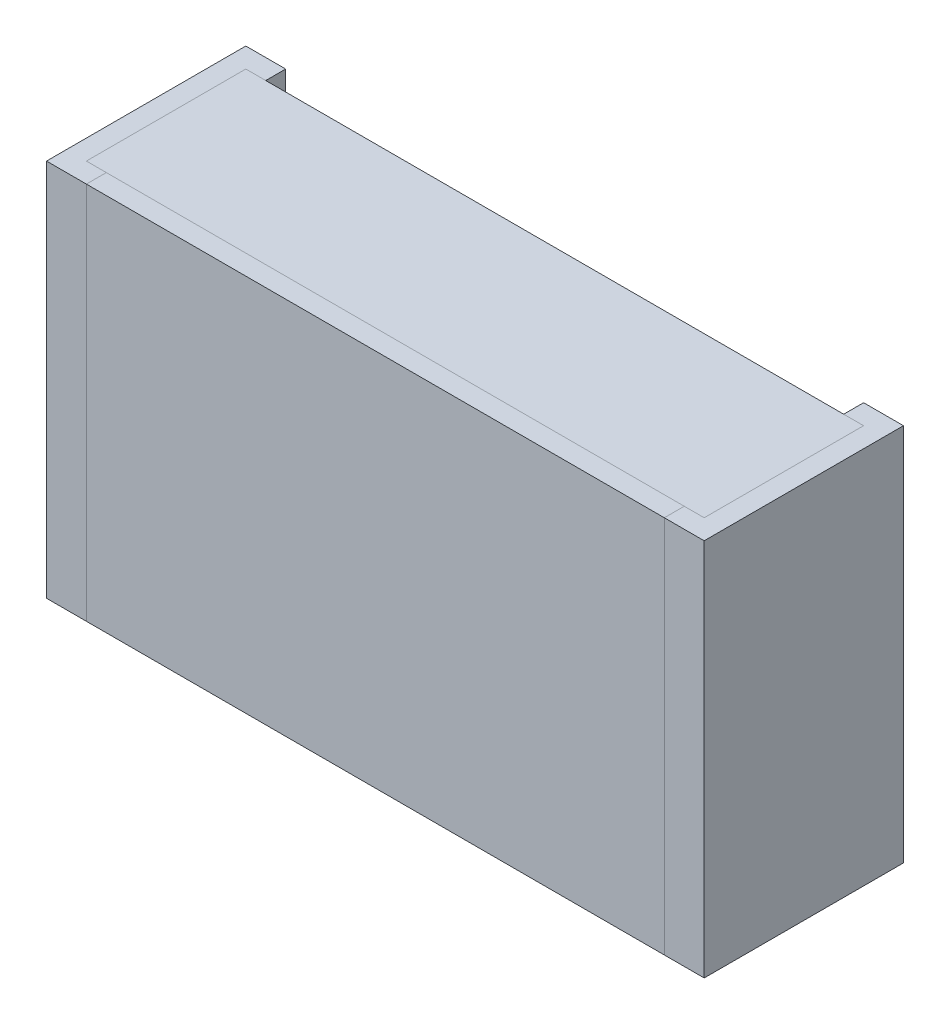
ISO-10303-21;
HEADER;
FILE_DESCRIPTION(('STEP AP214'),'2;1');
FILE_NAME('part.step','',(''),(''),'','','');
FILE_SCHEMA(('AUTOMOTIVE_DESIGN { 1 0 10303 214 1 1 1 1 }'));
ENDSEC;
DATA;
#1=APPLICATION_CONTEXT('core data for automotive mechanical design processes');
#2=APPLICATION_PROTOCOL_DEFINITION('international standard','automotive_design',2000,#1);
#3=PRODUCT_CONTEXT('',#1,'mechanical');
#4=PRODUCT('Part','Part','',(#3));
#5=PRODUCT_RELATED_PRODUCT_CATEGORY('part','',(#4));
#6=PRODUCT_DEFINITION_FORMATION('','',#4);
#7=PRODUCT_DEFINITION_CONTEXT('part definition',#1,'design');
#8=PRODUCT_DEFINITION('design','',#6,#7);
#9=PRODUCT_DEFINITION_SHAPE('','',#8);
#10=(LENGTH_UNIT() NAMED_UNIT(*) SI_UNIT(.MILLI.,.METRE.));
#11=(NAMED_UNIT(*) PLANE_ANGLE_UNIT() SI_UNIT($,.RADIAN.));
#12=(NAMED_UNIT(*) SI_UNIT($,.STERADIAN.) SOLID_ANGLE_UNIT());
#13=UNCERTAINTY_MEASURE_WITH_UNIT(LENGTH_MEASURE(1.E-05),#10,'distance_accuracy_value','');
#14=(GEOMETRIC_REPRESENTATION_CONTEXT(3) GLOBAL_UNCERTAINTY_ASSIGNED_CONTEXT((#13)) GLOBAL_UNIT_ASSIGNED_CONTEXT((#10,
#11,#12)) REPRESENTATION_CONTEXT('',''));
#15=CARTESIAN_POINT('',(0.,0.,0.));
#16=DIRECTION('',(0.,0.,1.));
#17=DIRECTION('',(1.,0.,0.));
#18=AXIS2_PLACEMENT_3D('',#15,#16,#17);
#19=CARTESIAN_POINT('',(-0.775,-0.475,0.05));
#20=DIRECTION('',(1.,0.,0.));
#21=DIRECTION('',(0.,0.,1.));
#22=AXIS2_PLACEMENT_3D('',#19,#20,#21);
#23=PLANE('',#22);
#24=DIRECTION('',(0.,1.,0.));
#25=VECTOR('',#24,1.);
#26=CARTESIAN_POINT('',(-0.775,-0.475,0.45));
#27=LINE('',#26,#25);
#28=CARTESIAN_POINT('',(-0.775,-0.475,0.45));
#29=VERTEX_POINT('',#28);
#30=CARTESIAN_POINT('',(-0.775,0.475,0.45));
#31=VERTEX_POINT('',#30);
#32=EDGE_CURVE('P0_E11',#29,#31,#27,.T.);
#33=ORIENTED_EDGE('',*,*,#32,.T.);
#34=DIRECTION('',(0.,0.,1.));
#35=VECTOR('',#34,1.);
#36=CARTESIAN_POINT('',(-0.775,0.475,0.05));
#37=LINE('',#36,#35);
#38=CARTESIAN_POINT('',(-0.775,0.475,0.05));
#39=VERTEX_POINT('',#38);
#40=EDGE_CURVE('P0_E24',#39,#31,#37,.T.);
#41=ORIENTED_EDGE('',*,*,#40,.F.);
#42=DIRECTION('',(0.,1.,0.));
#43=VECTOR('',#42,1.);
#44=CARTESIAN_POINT('',(-0.775,-0.475,0.05));
#45=LINE('',#44,#43);
#46=CARTESIAN_POINT('',(-0.775,-0.475,0.05));
#47=VERTEX_POINT('',#46);
#48=EDGE_CURVE('P0_E86',#47,#39,#45,.T.);
#49=ORIENTED_EDGE('',*,*,#48,.F.);
#50=DIRECTION('',(0.,0.,1.));
#51=VECTOR('',#50,1.);
#52=CARTESIAN_POINT('',(-0.775,-0.475,0.05));
#53=LINE('',#52,#51);
#54=EDGE_CURVE('P0_E36',#47,#29,#53,.T.);
#55=ORIENTED_EDGE('',*,*,#54,.T.);
#56=EDGE_LOOP('',(#33,#41,#49,#55));
#57=FACE_BOUND('',#56,.T.);
#58=ADVANCED_FACE('P0_F17',(#57),#23,.F.);
#59=CARTESIAN_POINT('',(0.775,-0.475,0.05));
#60=DIRECTION('',(1.,0.,0.));
#61=DIRECTION('',(0.,0.,1.));
#62=AXIS2_PLACEMENT_3D('',#59,#60,#61);
#63=PLANE('',#62);
#64=DIRECTION('',(0.,0.,1.));
#65=VECTOR('',#64,1.);
#66=CARTESIAN_POINT('',(0.775,-0.475,0.05));
#67=LINE('',#66,#65);
#68=CARTESIAN_POINT('',(0.775,-0.475,0.05));
#69=VERTEX_POINT('',#68);
#70=CARTESIAN_POINT('',(0.775,-0.475,0.45));
#71=VERTEX_POINT('',#70);
#72=EDGE_CURVE('P0_E83',#69,#71,#67,.T.);
#73=ORIENTED_EDGE('',*,*,#72,.F.);
#74=DIRECTION('',(0.,1.,0.));
#75=VECTOR('',#74,1.);
#76=CARTESIAN_POINT('',(0.775,-0.475,0.05));
#77=LINE('',#76,#75);
#78=CARTESIAN_POINT('',(0.775,0.475,0.05));
#79=VERTEX_POINT('',#78);
#80=EDGE_CURVE('P0_E63',#69,#79,#77,.T.);
#81=ORIENTED_EDGE('',*,*,#80,.T.);
#82=DIRECTION('',(0.,0.,1.));
#83=VECTOR('',#82,1.);
#84=CARTESIAN_POINT('',(0.775,0.475,0.05));
#85=LINE('',#84,#83);
#86=CARTESIAN_POINT('',(0.775,0.475,0.45));
#87=VERTEX_POINT('',#86);
#88=EDGE_CURVE('P0_E57',#79,#87,#85,.T.);
#89=ORIENTED_EDGE('',*,*,#88,.T.);
#90=DIRECTION('',(0.,1.,0.));
#91=VECTOR('',#90,1.);
#92=CARTESIAN_POINT('',(0.775,-0.475,0.45));
#93=LINE('',#92,#91);
#94=EDGE_CURVE('P0_E60',#71,#87,#93,.T.);
#95=ORIENTED_EDGE('',*,*,#94,.F.);
#96=EDGE_LOOP('',(#73,#81,#89,#95));
#97=FACE_BOUND('',#96,.T.);
#98=ADVANCED_FACE('P0_F59',(#97),#63,.T.);
#99=CARTESIAN_POINT('',(-0.775,-0.475,0.05));
#100=DIRECTION('',(0.,1.,0.));
#101=DIRECTION('',(0.,0.,1.));
#102=AXIS2_PLACEMENT_3D('',#99,#100,#101);
#103=PLANE('',#102);
#104=ORIENTED_EDGE('',*,*,#72,.T.);
#105=DIRECTION('',(1.,0.,0.));
#106=VECTOR('',#105,1.);
#107=CARTESIAN_POINT('',(-0.775,-0.475,0.45));
#108=LINE('',#107,#106);
#109=EDGE_CURVE('P0_E71',#29,#71,#108,.T.);
#110=ORIENTED_EDGE('',*,*,#109,.F.);
#111=ORIENTED_EDGE('',*,*,#54,.F.);
#112=DIRECTION('',(1.,0.,0.));
#113=VECTOR('',#112,1.);
#114=CARTESIAN_POINT('',(-0.775,-0.475,0.05));
#115=LINE('',#114,#113);
#116=EDGE_CURVE('P0_E76',#47,#69,#115,.T.);
#117=ORIENTED_EDGE('',*,*,#116,.T.);
#118=EDGE_LOOP('',(#104,#110,#111,#117));
#119=FACE_BOUND('',#118,.T.);
#120=ADVANCED_FACE('P0_F91',(#119),#103,.F.);
#121=CARTESIAN_POINT('',(-0.775,0.475,0.05));
#122=DIRECTION('',(0.,1.,0.));
#123=DIRECTION('',(0.,0.,1.));
#124=AXIS2_PLACEMENT_3D('',#121,#122,#123);
#125=PLANE('',#124);
#126=DIRECTION('',(1.,0.,0.));
#127=VECTOR('',#126,1.);
#128=CARTESIAN_POINT('',(-0.775,0.475,0.05));
#129=LINE('',#128,#127);
#130=EDGE_CURVE('P0_E74',#39,#79,#129,.T.);
#131=ORIENTED_EDGE('',*,*,#130,.F.);
#132=ORIENTED_EDGE('',*,*,#40,.T.);
#133=DIRECTION('',(1.,0.,0.));
#134=VECTOR('',#133,1.);
#135=CARTESIAN_POINT('',(-0.775,0.475,0.45));
#136=LINE('',#135,#134);
#137=EDGE_CURVE('P0_E69',#31,#87,#136,.T.);
#138=ORIENTED_EDGE('',*,*,#137,.T.);
#139=ORIENTED_EDGE('',*,*,#88,.F.);
#140=EDGE_LOOP('',(#131,#132,#138,#139));
#141=FACE_BOUND('',#140,.T.);
#142=ADVANCED_FACE('P0_F73',(#141),#125,.T.);
#143=CARTESIAN_POINT('',(-0.775,-0.475,0.05));
#144=DIRECTION('',(0.,0.,1.));
#145=DIRECTION('',(1.,0.,0.));
#146=AXIS2_PLACEMENT_3D('',#143,#144,#145);
#147=PLANE('',#146);
#148=ORIENTED_EDGE('',*,*,#130,.T.);
#149=ORIENTED_EDGE('',*,*,#80,.F.);
#150=ORIENTED_EDGE('',*,*,#116,.F.);
#151=ORIENTED_EDGE('',*,*,#48,.T.);
#152=EDGE_LOOP('',(#148,#149,#150,#151));
#153=FACE_BOUND('',#152,.T.);
#154=ADVANCED_FACE('P0_F89',(#153),#147,.F.);
#155=CARTESIAN_POINT('',(-0.775,-0.475,0.45));
#156=DIRECTION('',(0.,0.,1.));
#157=DIRECTION('',(1.,0.,0.));
#158=AXIS2_PLACEMENT_3D('',#155,#156,#157);
#159=PLANE('',#158);
#160=ORIENTED_EDGE('',*,*,#32,.F.);
#161=ORIENTED_EDGE('',*,*,#109,.T.);
#162=ORIENTED_EDGE('',*,*,#94,.T.);
#163=ORIENTED_EDGE('',*,*,#137,.F.);
#164=EDGE_LOOP('',(#160,#161,#162,#163));
#165=FACE_BOUND('',#164,.T.);
#166=ADVANCED_FACE('P0_F68',(#165),#159,.T.);
#167=CLOSED_SHELL('',(#58,#98,#120,#142,#154,#166));
#168=MANIFOLD_SOLID_BREP('P0_B1',#167);
#169=CARTESIAN_POINT('',(-0.825,-0.475,0.));
#170=DIRECTION('',(1.,0.,0.));
#171=DIRECTION('',(0.,0.,1.));
#172=AXIS2_PLACEMENT_3D('',#169,#170,#171);
#173=PLANE('',#172);
#174=DIRECTION('',(0.,1.,0.));
#175=VECTOR('',#174,1.);
#176=CARTESIAN_POINT('',(-0.825,-0.475,0.5));
#177=LINE('',#176,#175);
#178=CARTESIAN_POINT('',(-0.825,-0.475,0.5));
#179=VERTEX_POINT('',#178);
#180=CARTESIAN_POINT('',(-0.825,0.475,0.5));
#181=VERTEX_POINT('',#180);
#182=EDGE_CURVE('P1_E11',#179,#181,#177,.T.);
#183=ORIENTED_EDGE('',*,*,#182,.T.);
#184=DIRECTION('',(0.,0.,1.));
#185=VECTOR('',#184,1.);
#186=CARTESIAN_POINT('',(-0.825,0.475,0.));
#187=LINE('',#186,#185);
#188=CARTESIAN_POINT('',(-0.825,0.475,0.));
#189=VERTEX_POINT('',#188);
#190=EDGE_CURVE('P1_E24',#189,#181,#187,.T.);
#191=ORIENTED_EDGE('',*,*,#190,.F.);
#192=DIRECTION('',(0.,1.,0.));
#193=VECTOR('',#192,1.);
#194=CARTESIAN_POINT('',(-0.825,-0.475,0.));
#195=LINE('',#194,#193);
#196=CARTESIAN_POINT('',(-0.825,-0.475,0.));
#197=VERTEX_POINT('',#196);
#198=EDGE_CURVE('P1_E144',#197,#189,#195,.T.);
#199=ORIENTED_EDGE('',*,*,#198,.F.);
#200=DIRECTION('',(0.,0.,1.));
#201=VECTOR('',#200,1.);
#202=CARTESIAN_POINT('',(-0.825,-0.475,0.));
#203=LINE('',#202,#201);
#204=EDGE_CURVE('P1_E36',#197,#179,#203,.T.);
#205=ORIENTED_EDGE('',*,*,#204,.T.);
#206=EDGE_LOOP('',(#183,#191,#199,#205));
#207=FACE_BOUND('',#206,.T.);
#208=ADVANCED_FACE('P1_F17',(#207),#173,.F.);
#209=CARTESIAN_POINT('',(-0.825,-0.475,0.));
#210=DIRECTION('',(0.,1.,0.));
#211=DIRECTION('',(0.,0.,1.));
#212=AXIS2_PLACEMENT_3D('',#209,#210,#211);
#213=PLANE('',#212);
#214=DIRECTION('',(1.,0.,0.));
#215=VECTOR('',#214,1.);
#216=CARTESIAN_POINT('',(-0.775,-0.475,0.05));
#217=LINE('',#216,#215);
#218=CARTESIAN_POINT('',(-0.775,-0.475,0.05));
#219=VERTEX_POINT('',#218);
#220=CARTESIAN_POINT('',(-0.725,-0.475,0.05));
#221=VERTEX_POINT('',#220);
#222=EDGE_CURVE('P1_E141',#219,#221,#217,.T.);
#223=ORIENTED_EDGE('',*,*,#222,.F.);
#224=DIRECTION('',(0.,0.,1.));
#225=VECTOR('',#224,1.);
#226=CARTESIAN_POINT('',(-0.775,-0.475,0.05));
#227=LINE('',#226,#225);
#228=CARTESIAN_POINT('',(-0.775,-0.475,0.45));
#229=VERTEX_POINT('',#228);
#230=EDGE_CURVE('P1_E103',#219,#229,#227,.T.);
#231=ORIENTED_EDGE('',*,*,#230,.T.);
#232=DIRECTION('',(1.,0.,0.));
#233=VECTOR('',#232,1.);
#234=CARTESIAN_POINT('',(-0.775,-0.475,0.45));
#235=LINE('',#234,#233);
#236=CARTESIAN_POINT('',(-0.725,-0.475,0.45));
#237=VERTEX_POINT('',#236);
#238=EDGE_CURVE('P1_E137',#229,#237,#235,.T.);
#239=ORIENTED_EDGE('',*,*,#238,.T.);
#240=DIRECTION('',(0.,0.,1.));
#241=VECTOR('',#240,1.);
#242=CARTESIAN_POINT('',(-0.725,-0.475,0.));
#243=LINE('',#242,#241);
#244=CARTESIAN_POINT('',(-0.725,-0.475,0.5));
#245=VERTEX_POINT('',#244);
#246=EDGE_CURVE('P1_E134',#237,#245,#243,.T.);
#247=ORIENTED_EDGE('',*,*,#246,.T.);
#248=DIRECTION('',(1.,0.,0.));
#249=VECTOR('',#248,1.);
#250=CARTESIAN_POINT('',(-0.825,-0.475,0.5));
#251=LINE('',#250,#249);
#252=EDGE_CURVE('P1_E132',#179,#245,#251,.T.);
#253=ORIENTED_EDGE('',*,*,#252,.F.);
#254=ORIENTED_EDGE('',*,*,#204,.F.);
#255=DIRECTION('',(1.,0.,0.));
#256=VECTOR('',#255,1.);
#257=CARTESIAN_POINT('',(-0.825,-0.475,0.));
#258=LINE('',#257,#256);
#259=CARTESIAN_POINT('',(-0.725,-0.475,0.));
#260=VERTEX_POINT('',#259);
#261=EDGE_CURVE('P1_E129',#197,#260,#258,.T.);
#262=ORIENTED_EDGE('',*,*,#261,.T.);
#263=DIRECTION('',(0.,0.,1.));
#264=VECTOR('',#263,1.);
#265=CARTESIAN_POINT('',(-0.725,-0.475,0.));
#266=LINE('',#265,#264);
#267=EDGE_CURVE('P1_E127',#260,#221,#266,.T.);
#268=ORIENTED_EDGE('',*,*,#267,.T.);
#269=EDGE_LOOP('',(#223,#231,#239,#247,#253,#254,#262,#268));
#270=FACE_BOUND('',#269,.T.);
#271=ADVANCED_FACE('P1_F153',(#270),#213,.F.);
#272=CARTESIAN_POINT('',(-0.825,-0.475,0.5));
#273=DIRECTION('',(0.,0.,1.));
#274=DIRECTION('',(1.,0.,0.));
#275=AXIS2_PLACEMENT_3D('',#272,#273,#274);
#276=PLANE('',#275);
#277=ORIENTED_EDGE('',*,*,#182,.F.);
#278=ORIENTED_EDGE('',*,*,#252,.T.);
#279=DIRECTION('',(0.,1.,0.));
#280=VECTOR('',#279,1.);
#281=CARTESIAN_POINT('',(-0.725,-0.475,0.5));
#282=LINE('',#281,#280);
#283=CARTESIAN_POINT('',(-0.725,0.475,0.5));
#284=VERTEX_POINT('',#283);
#285=EDGE_CURVE('P1_E125',#245,#284,#282,.T.);
#286=ORIENTED_EDGE('',*,*,#285,.T.);
#287=DIRECTION('',(1.,0.,0.));
#288=VECTOR('',#287,1.);
#289=CARTESIAN_POINT('',(-0.825,0.475,0.5));
#290=LINE('',#289,#288);
#291=EDGE_CURVE('P1_E123',#181,#284,#290,.T.);
#292=ORIENTED_EDGE('',*,*,#291,.F.);
#293=EDGE_LOOP('',(#277,#278,#286,#292));
#294=FACE_BOUND('',#293,.T.);
#295=ADVANCED_FACE('P1_F157',(#294),#276,.T.);
#296=CARTESIAN_POINT('',(-0.825,0.475,0.));
#297=DIRECTION('',(0.,1.,0.));
#298=DIRECTION('',(0.,0.,1.));
#299=AXIS2_PLACEMENT_3D('',#296,#297,#298);
#300=PLANE('',#299);
#301=DIRECTION('',(0.,0.,1.));
#302=VECTOR('',#301,1.);
#303=CARTESIAN_POINT('',(-0.725,0.475,0.));
#304=LINE('',#303,#302);
#305=CARTESIAN_POINT('',(-0.725,0.475,0.));
#306=VERTEX_POINT('',#305);
#307=CARTESIAN_POINT('',(-0.725,0.475,0.05));
#308=VERTEX_POINT('',#307);
#309=EDGE_CURVE('P1_E121',#306,#308,#304,.T.);
#310=ORIENTED_EDGE('',*,*,#309,.F.);
#311=DIRECTION('',(1.,0.,0.));
#312=VECTOR('',#311,1.);
#313=CARTESIAN_POINT('',(-0.825,0.475,0.));
#314=LINE('',#313,#312);
#315=EDGE_CURVE('P1_E118',#189,#306,#314,.T.);
#316=ORIENTED_EDGE('',*,*,#315,.F.);
#317=ORIENTED_EDGE('',*,*,#190,.T.);
#318=ORIENTED_EDGE('',*,*,#291,.T.);
#319=DIRECTION('',(0.,0.,1.));
#320=VECTOR('',#319,1.);
#321=CARTESIAN_POINT('',(-0.725,0.475,0.));
#322=LINE('',#321,#320);
#323=CARTESIAN_POINT('',(-0.725,0.475,0.45));
#324=VERTEX_POINT('',#323);
#325=EDGE_CURVE('P1_E115',#324,#284,#322,.T.);
#326=ORIENTED_EDGE('',*,*,#325,.F.);
#327=DIRECTION('',(1.,0.,0.));
#328=VECTOR('',#327,1.);
#329=CARTESIAN_POINT('',(-0.775,0.475,0.45));
#330=LINE('',#329,#328);
#331=CARTESIAN_POINT('',(-0.775,0.475,0.45));
#332=VERTEX_POINT('',#331);
#333=EDGE_CURVE('P1_E86',#332,#324,#330,.T.);
#334=ORIENTED_EDGE('',*,*,#333,.F.);
#335=DIRECTION('',(0.,0.,1.));
#336=VECTOR('',#335,1.);
#337=CARTESIAN_POINT('',(-0.775,0.475,0.05));
#338=LINE('',#337,#336);
#339=CARTESIAN_POINT('',(-0.775,0.475,0.05));
#340=VERTEX_POINT('',#339);
#341=EDGE_CURVE('P1_E80',#340,#332,#338,.T.);
#342=ORIENTED_EDGE('',*,*,#341,.F.);
#343=DIRECTION('',(1.,0.,0.));
#344=VECTOR('',#343,1.);
#345=CARTESIAN_POINT('',(-0.775,0.475,0.05));
#346=LINE('',#345,#344);
#347=EDGE_CURVE('P1_E83',#340,#308,#346,.T.);
#348=ORIENTED_EDGE('',*,*,#347,.T.);
#349=EDGE_LOOP('',(#310,#316,#317,#318,#326,#334,#342,#348));
#350=FACE_BOUND('',#349,.T.);
#351=ADVANCED_FACE('P1_F82',(#350),#300,.T.);
#352=CARTESIAN_POINT('',(-0.825,-0.475,0.));
#353=DIRECTION('',(0.,0.,1.));
#354=DIRECTION('',(1.,0.,0.));
#355=AXIS2_PLACEMENT_3D('',#352,#353,#354);
#356=PLANE('',#355);
#357=ORIENTED_EDGE('',*,*,#315,.T.);
#358=DIRECTION('',(0.,1.,0.));
#359=VECTOR('',#358,1.);
#360=CARTESIAN_POINT('',(-0.725,-0.475,0.));
#361=LINE('',#360,#359);
#362=EDGE_CURVE('P1_E99',#260,#306,#361,.T.);
#363=ORIENTED_EDGE('',*,*,#362,.F.);
#364=ORIENTED_EDGE('',*,*,#261,.F.);
#365=ORIENTED_EDGE('',*,*,#198,.T.);
#366=EDGE_LOOP('',(#357,#363,#364,#365));
#367=FACE_BOUND('',#366,.T.);
#368=ADVANCED_FACE('P1_F147',(#367),#356,.F.);
#369=CARTESIAN_POINT('',(-0.725,-0.475,0.));
#370=DIRECTION('',(1.,0.,0.));
#371=DIRECTION('',(0.,0.,1.));
#372=AXIS2_PLACEMENT_3D('',#369,#370,#371);
#373=PLANE('',#372);
#374=ORIENTED_EDGE('',*,*,#267,.F.);
#375=ORIENTED_EDGE('',*,*,#362,.T.);
#376=ORIENTED_EDGE('',*,*,#309,.T.);
#377=DIRECTION('',(0.,-1.,0.));
#378=VECTOR('',#377,1.);
#379=CARTESIAN_POINT('',(-0.725,-0.475,0.05));
#380=LINE('',#379,#378);
#381=EDGE_CURVE('P1_E98',#308,#221,#380,.T.);
#382=ORIENTED_EDGE('',*,*,#381,.T.);
#383=EDGE_LOOP('',(#374,#375,#376,#382));
#384=FACE_BOUND('',#383,.T.);
#385=ADVANCED_FACE('P1_F151',(#384),#373,.T.);
#386=CARTESIAN_POINT('',(-0.775,-0.475,0.05));
#387=DIRECTION('',(0.,0.,1.));
#388=DIRECTION('',(1.,0.,0.));
#389=AXIS2_PLACEMENT_3D('',#386,#387,#388);
#390=PLANE('',#389);
#391=ORIENTED_EDGE('',*,*,#347,.F.);
#392=DIRECTION('',(0.,1.,0.));
#393=VECTOR('',#392,1.);
#394=CARTESIAN_POINT('',(-0.775,-0.475,0.05));
#395=LINE('',#394,#393);
#396=EDGE_CURVE('P1_E96',#219,#340,#395,.T.);
#397=ORIENTED_EDGE('',*,*,#396,.F.);
#398=ORIENTED_EDGE('',*,*,#222,.T.);
#399=ORIENTED_EDGE('',*,*,#381,.F.);
#400=EDGE_LOOP('',(#391,#397,#398,#399));
#401=FACE_BOUND('',#400,.T.);
#402=ADVANCED_FACE('P1_F94',(#401),#390,.T.);
#403=CARTESIAN_POINT('',(-0.775,-0.475,0.05));
#404=DIRECTION('',(1.,0.,0.));
#405=DIRECTION('',(0.,0.,1.));
#406=AXIS2_PLACEMENT_3D('',#403,#404,#405);
#407=PLANE('',#406);
#408=ORIENTED_EDGE('',*,*,#230,.F.);
#409=ORIENTED_EDGE('',*,*,#396,.T.);
#410=ORIENTED_EDGE('',*,*,#341,.T.);
#411=DIRECTION('',(0.,1.,0.));
#412=VECTOR('',#411,1.);
#413=CARTESIAN_POINT('',(-0.775,-0.475,0.45));
#414=LINE('',#413,#412);
#415=EDGE_CURVE('P1_E105',#229,#332,#414,.T.);
#416=ORIENTED_EDGE('',*,*,#415,.F.);
#417=EDGE_LOOP('',(#408,#409,#410,#416));
#418=FACE_BOUND('',#417,.T.);
#419=ADVANCED_FACE('P1_F101',(#418),#407,.T.);
#420=CARTESIAN_POINT('',(-0.775,-0.475,0.45));
#421=DIRECTION('',(0.,0.,1.));
#422=DIRECTION('',(1.,0.,0.));
#423=AXIS2_PLACEMENT_3D('',#420,#421,#422);
#424=PLANE('',#423);
#425=DIRECTION('',(0.,-1.,0.));
#426=VECTOR('',#425,1.);
#427=CARTESIAN_POINT('',(-0.725,-0.475,0.45));
#428=LINE('',#427,#426);
#429=EDGE_CURVE('P1_E108',#324,#237,#428,.T.);
#430=ORIENTED_EDGE('',*,*,#429,.T.);
#431=ORIENTED_EDGE('',*,*,#238,.F.);
#432=ORIENTED_EDGE('',*,*,#415,.T.);
#433=ORIENTED_EDGE('',*,*,#333,.T.);
#434=EDGE_LOOP('',(#430,#431,#432,#433));
#435=FACE_BOUND('',#434,.T.);
#436=ADVANCED_FACE('P1_F163',(#435),#424,.F.);
#437=CARTESIAN_POINT('',(-0.725,-0.475,0.));
#438=DIRECTION('',(1.,0.,0.));
#439=DIRECTION('',(0.,0.,1.));
#440=AXIS2_PLACEMENT_3D('',#437,#438,#439);
#441=PLANE('',#440);
#442=ORIENTED_EDGE('',*,*,#246,.F.);
#443=ORIENTED_EDGE('',*,*,#429,.F.);
#444=ORIENTED_EDGE('',*,*,#325,.T.);
#445=ORIENTED_EDGE('',*,*,#285,.F.);
#446=EDGE_LOOP('',(#442,#443,#444,#445));
#447=FACE_BOUND('',#446,.T.);
#448=ADVANCED_FACE('P1_F160',(#447),#441,.T.);
#449=CLOSED_SHELL('',(#208,#271,#295,#351,#368,#385,#402,#419,#436,#448));
#450=MANIFOLD_SOLID_BREP('P1_B1',#449);
#451=CARTESIAN_POINT('',(0.825,0.475,0.));
#452=DIRECTION('',(-1.,0.,0.));
#453=DIRECTION('',(0.,0.,1.));
#454=AXIS2_PLACEMENT_3D('',#451,#452,#453);
#455=PLANE('',#454);
#456=DIRECTION('',(0.,-1.,0.));
#457=VECTOR('',#456,1.);
#458=CARTESIAN_POINT('',(0.825,0.475,0.5));
#459=LINE('',#458,#457);
#460=CARTESIAN_POINT('',(0.825,0.475,0.5));
#461=VERTEX_POINT('',#460);
#462=CARTESIAN_POINT('',(0.825,-0.475,0.5));
#463=VERTEX_POINT('',#462);
#464=EDGE_CURVE('P2_E11',#461,#463,#459,.T.);
#465=ORIENTED_EDGE('',*,*,#464,.T.);
#466=DIRECTION('',(0.,0.,1.));
#467=VECTOR('',#466,1.);
#468=CARTESIAN_POINT('',(0.825,-0.475,0.));
#469=LINE('',#468,#467);
#470=CARTESIAN_POINT('',(0.825,-0.475,0.));
#471=VERTEX_POINT('',#470);
#472=EDGE_CURVE('P2_E24',#471,#463,#469,.T.);
#473=ORIENTED_EDGE('',*,*,#472,.F.);
#474=DIRECTION('',(0.,-1.,0.));
#475=VECTOR('',#474,1.);
#476=CARTESIAN_POINT('',(0.825,0.475,0.));
#477=LINE('',#476,#475);
#478=CARTESIAN_POINT('',(0.825,0.475,0.));
#479=VERTEX_POINT('',#478);
#480=EDGE_CURVE('P2_E144',#479,#471,#477,.T.);
#481=ORIENTED_EDGE('',*,*,#480,.F.);
#482=DIRECTION('',(0.,0.,1.));
#483=VECTOR('',#482,1.);
#484=CARTESIAN_POINT('',(0.825,0.475,0.));
#485=LINE('',#484,#483);
#486=EDGE_CURVE('P2_E36',#479,#461,#485,.T.);
#487=ORIENTED_EDGE('',*,*,#486,.T.);
#488=EDGE_LOOP('',(#465,#473,#481,#487));
#489=FACE_BOUND('',#488,.T.);
#490=ADVANCED_FACE('P2_F17',(#489),#455,.F.);
#491=CARTESIAN_POINT('',(0.825,0.475,0.));
#492=DIRECTION('',(0.,-1.,0.));
#493=DIRECTION('',(0.,0.,1.));
#494=AXIS2_PLACEMENT_3D('',#491,#492,#493);
#495=PLANE('',#494);
#496=DIRECTION('',(-1.,0.,0.));
#497=VECTOR('',#496,1.);
#498=CARTESIAN_POINT('',(0.775,0.475,0.05));
#499=LINE('',#498,#497);
#500=CARTESIAN_POINT('',(0.775,0.475,0.05));
#501=VERTEX_POINT('',#500);
#502=CARTESIAN_POINT('',(0.725,0.475,0.05));
#503=VERTEX_POINT('',#502);
#504=EDGE_CURVE('P2_E141',#501,#503,#499,.T.);
#505=ORIENTED_EDGE('',*,*,#504,.F.);
#506=DIRECTION('',(0.,0.,1.));
#507=VECTOR('',#506,1.);
#508=CARTESIAN_POINT('',(0.775,0.475,0.05));
#509=LINE('',#508,#507);
#510=CARTESIAN_POINT('',(0.775,0.475,0.45));
#511=VERTEX_POINT('',#510);
#512=EDGE_CURVE('P2_E103',#501,#511,#509,.T.);
#513=ORIENTED_EDGE('',*,*,#512,.T.);
#514=DIRECTION('',(-1.,0.,0.));
#515=VECTOR('',#514,1.);
#516=CARTESIAN_POINT('',(0.775,0.475,0.45));
#517=LINE('',#516,#515);
#518=CARTESIAN_POINT('',(0.725,0.475,0.45));
#519=VERTEX_POINT('',#518);
#520=EDGE_CURVE('P2_E137',#511,#519,#517,.T.);
#521=ORIENTED_EDGE('',*,*,#520,.T.);
#522=DIRECTION('',(0.,0.,1.));
#523=VECTOR('',#522,1.);
#524=CARTESIAN_POINT('',(0.725,0.475,0.));
#525=LINE('',#524,#523);
#526=CARTESIAN_POINT('',(0.725,0.475,0.5));
#527=VERTEX_POINT('',#526);
#528=EDGE_CURVE('P2_E134',#519,#527,#525,.T.);
#529=ORIENTED_EDGE('',*,*,#528,.T.);
#530=DIRECTION('',(-1.,0.,0.));
#531=VECTOR('',#530,1.);
#532=CARTESIAN_POINT('',(0.825,0.475,0.5));
#533=LINE('',#532,#531);
#534=EDGE_CURVE('P2_E132',#461,#527,#533,.T.);
#535=ORIENTED_EDGE('',*,*,#534,.F.);
#536=ORIENTED_EDGE('',*,*,#486,.F.);
#537=DIRECTION('',(-1.,0.,0.));
#538=VECTOR('',#537,1.);
#539=CARTESIAN_POINT('',(0.825,0.475,0.));
#540=LINE('',#539,#538);
#541=CARTESIAN_POINT('',(0.725,0.475,0.));
#542=VERTEX_POINT('',#541);
#543=EDGE_CURVE('P2_E129',#479,#542,#540,.T.);
#544=ORIENTED_EDGE('',*,*,#543,.T.);
#545=DIRECTION('',(0.,0.,1.));
#546=VECTOR('',#545,1.);
#547=CARTESIAN_POINT('',(0.725,0.475,0.));
#548=LINE('',#547,#546);
#549=EDGE_CURVE('P2_E127',#542,#503,#548,.T.);
#550=ORIENTED_EDGE('',*,*,#549,.T.);
#551=EDGE_LOOP('',(#505,#513,#521,#529,#535,#536,#544,#550));
#552=FACE_BOUND('',#551,.T.);
#553=ADVANCED_FACE('P2_F153',(#552),#495,.F.);
#554=CARTESIAN_POINT('',(0.825,0.475,0.5));
#555=DIRECTION('',(0.,0.,1.));
#556=DIRECTION('',(-1.,0.,0.));
#557=AXIS2_PLACEMENT_3D('',#554,#555,#556);
#558=PLANE('',#557);
#559=ORIENTED_EDGE('',*,*,#464,.F.);
#560=ORIENTED_EDGE('',*,*,#534,.T.);
#561=DIRECTION('',(0.,-1.,0.));
#562=VECTOR('',#561,1.);
#563=CARTESIAN_POINT('',(0.725,0.475,0.5));
#564=LINE('',#563,#562);
#565=CARTESIAN_POINT('',(0.725,-0.475,0.5));
#566=VERTEX_POINT('',#565);
#567=EDGE_CURVE('P2_E125',#527,#566,#564,.T.);
#568=ORIENTED_EDGE('',*,*,#567,.T.);
#569=DIRECTION('',(-1.,0.,0.));
#570=VECTOR('',#569,1.);
#571=CARTESIAN_POINT('',(0.825,-0.475,0.5));
#572=LINE('',#571,#570);
#573=EDGE_CURVE('P2_E123',#463,#566,#572,.T.);
#574=ORIENTED_EDGE('',*,*,#573,.F.);
#575=EDGE_LOOP('',(#559,#560,#568,#574));
#576=FACE_BOUND('',#575,.T.);
#577=ADVANCED_FACE('P2_F157',(#576),#558,.T.);
#578=CARTESIAN_POINT('',(0.825,-0.475,0.));
#579=DIRECTION('',(0.,-1.,0.));
#580=DIRECTION('',(0.,0.,1.));
#581=AXIS2_PLACEMENT_3D('',#578,#579,#580);
#582=PLANE('',#581);
#583=DIRECTION('',(0.,0.,1.));
#584=VECTOR('',#583,1.);
#585=CARTESIAN_POINT('',(0.725,-0.475,0.));
#586=LINE('',#585,#584);
#587=CARTESIAN_POINT('',(0.725,-0.475,0.));
#588=VERTEX_POINT('',#587);
#589=CARTESIAN_POINT('',(0.725,-0.475,0.05));
#590=VERTEX_POINT('',#589);
#591=EDGE_CURVE('P2_E121',#588,#590,#586,.T.);
#592=ORIENTED_EDGE('',*,*,#591,.F.);
#593=DIRECTION('',(-1.,0.,0.));
#594=VECTOR('',#593,1.);
#595=CARTESIAN_POINT('',(0.825,-0.475,0.));
#596=LINE('',#595,#594);
#597=EDGE_CURVE('P2_E118',#471,#588,#596,.T.);
#598=ORIENTED_EDGE('',*,*,#597,.F.);
#599=ORIENTED_EDGE('',*,*,#472,.T.);
#600=ORIENTED_EDGE('',*,*,#573,.T.);
#601=DIRECTION('',(0.,0.,1.));
#602=VECTOR('',#601,1.);
#603=CARTESIAN_POINT('',(0.725,-0.475,0.));
#604=LINE('',#603,#602);
#605=CARTESIAN_POINT('',(0.725,-0.475,0.45));
#606=VERTEX_POINT('',#605);
#607=EDGE_CURVE('P2_E115',#606,#566,#604,.T.);
#608=ORIENTED_EDGE('',*,*,#607,.F.);
#609=DIRECTION('',(-1.,0.,0.));
#610=VECTOR('',#609,1.);
#611=CARTESIAN_POINT('',(0.775,-0.475,0.45));
#612=LINE('',#611,#610);
#613=CARTESIAN_POINT('',(0.775,-0.475,0.45));
#614=VERTEX_POINT('',#613);
#615=EDGE_CURVE('P2_E86',#614,#606,#612,.T.);
#616=ORIENTED_EDGE('',*,*,#615,.F.);
#617=DIRECTION('',(0.,0.,1.));
#618=VECTOR('',#617,1.);
#619=CARTESIAN_POINT('',(0.775,-0.475,0.05));
#620=LINE('',#619,#618);
#621=CARTESIAN_POINT('',(0.775,-0.475,0.05));
#622=VERTEX_POINT('',#621);
#623=EDGE_CURVE('P2_E80',#622,#614,#620,.T.);
#624=ORIENTED_EDGE('',*,*,#623,.F.);
#625=DIRECTION('',(-1.,0.,0.));
#626=VECTOR('',#625,1.);
#627=CARTESIAN_POINT('',(0.775,-0.475,0.05));
#628=LINE('',#627,#626);
#629=EDGE_CURVE('P2_E83',#622,#590,#628,.T.);
#630=ORIENTED_EDGE('',*,*,#629,.T.);
#631=EDGE_LOOP('',(#592,#598,#599,#600,#608,#616,#624,#630));
#632=FACE_BOUND('',#631,.T.);
#633=ADVANCED_FACE('P2_F82',(#632),#582,.T.);
#634=CARTESIAN_POINT('',(0.825,0.475,0.));
#635=DIRECTION('',(0.,0.,1.));
#636=DIRECTION('',(-1.,0.,0.));
#637=AXIS2_PLACEMENT_3D('',#634,#635,#636);
#638=PLANE('',#637);
#639=ORIENTED_EDGE('',*,*,#597,.T.);
#640=DIRECTION('',(0.,-1.,0.));
#641=VECTOR('',#640,1.);
#642=CARTESIAN_POINT('',(0.725,0.475,0.));
#643=LINE('',#642,#641);
#644=EDGE_CURVE('P2_E99',#542,#588,#643,.T.);
#645=ORIENTED_EDGE('',*,*,#644,.F.);
#646=ORIENTED_EDGE('',*,*,#543,.F.);
#647=ORIENTED_EDGE('',*,*,#480,.T.);
#648=EDGE_LOOP('',(#639,#645,#646,#647));
#649=FACE_BOUND('',#648,.T.);
#650=ADVANCED_FACE('P2_F147',(#649),#638,.F.);
#651=CARTESIAN_POINT('',(0.725,0.475,0.));
#652=DIRECTION('',(-1.,0.,0.));
#653=DIRECTION('',(0.,0.,1.));
#654=AXIS2_PLACEMENT_3D('',#651,#652,#653);
#655=PLANE('',#654);
#656=ORIENTED_EDGE('',*,*,#549,.F.);
#657=ORIENTED_EDGE('',*,*,#644,.T.);
#658=ORIENTED_EDGE('',*,*,#591,.T.);
#659=DIRECTION('',(0.,1.,0.));
#660=VECTOR('',#659,1.);
#661=CARTESIAN_POINT('',(0.725,0.475,0.05));
#662=LINE('',#661,#660);
#663=EDGE_CURVE('P2_E98',#590,#503,#662,.T.);
#664=ORIENTED_EDGE('',*,*,#663,.T.);
#665=EDGE_LOOP('',(#656,#657,#658,#664));
#666=FACE_BOUND('',#665,.T.);
#667=ADVANCED_FACE('P2_F151',(#666),#655,.T.);
#668=CARTESIAN_POINT('',(0.775,0.475,0.05));
#669=DIRECTION('',(0.,0.,1.));
#670=DIRECTION('',(-1.,0.,0.));
#671=AXIS2_PLACEMENT_3D('',#668,#669,#670);
#672=PLANE('',#671);
#673=ORIENTED_EDGE('',*,*,#629,.F.);
#674=DIRECTION('',(0.,-1.,0.));
#675=VECTOR('',#674,1.);
#676=CARTESIAN_POINT('',(0.775,0.475,0.05));
#677=LINE('',#676,#675);
#678=EDGE_CURVE('P2_E96',#501,#622,#677,.T.);
#679=ORIENTED_EDGE('',*,*,#678,.F.);
#680=ORIENTED_EDGE('',*,*,#504,.T.);
#681=ORIENTED_EDGE('',*,*,#663,.F.);
#682=EDGE_LOOP('',(#673,#679,#680,#681));
#683=FACE_BOUND('',#682,.T.);
#684=ADVANCED_FACE('P2_F94',(#683),#672,.T.);
#685=CARTESIAN_POINT('',(0.775,0.475,0.05));
#686=DIRECTION('',(-1.,0.,0.));
#687=DIRECTION('',(0.,0.,1.));
#688=AXIS2_PLACEMENT_3D('',#685,#686,#687);
#689=PLANE('',#688);
#690=ORIENTED_EDGE('',*,*,#512,.F.);
#691=ORIENTED_EDGE('',*,*,#678,.T.);
#692=ORIENTED_EDGE('',*,*,#623,.T.);
#693=DIRECTION('',(0.,-1.,0.));
#694=VECTOR('',#693,1.);
#695=CARTESIAN_POINT('',(0.775,0.475,0.45));
#696=LINE('',#695,#694);
#697=EDGE_CURVE('P2_E105',#511,#614,#696,.T.);
#698=ORIENTED_EDGE('',*,*,#697,.F.);
#699=EDGE_LOOP('',(#690,#691,#692,#698));
#700=FACE_BOUND('',#699,.T.);
#701=ADVANCED_FACE('P2_F101',(#700),#689,.T.);
#702=CARTESIAN_POINT('',(0.775,0.475,0.45));
#703=DIRECTION('',(0.,0.,1.));
#704=DIRECTION('',(-1.,0.,0.));
#705=AXIS2_PLACEMENT_3D('',#702,#703,#704);
#706=PLANE('',#705);
#707=DIRECTION('',(0.,1.,0.));
#708=VECTOR('',#707,1.);
#709=CARTESIAN_POINT('',(0.725,0.475,0.45));
#710=LINE('',#709,#708);
#711=EDGE_CURVE('P2_E108',#606,#519,#710,.T.);
#712=ORIENTED_EDGE('',*,*,#711,.T.);
#713=ORIENTED_EDGE('',*,*,#520,.F.);
#714=ORIENTED_EDGE('',*,*,#697,.T.);
#715=ORIENTED_EDGE('',*,*,#615,.T.);
#716=EDGE_LOOP('',(#712,#713,#714,#715));
#717=FACE_BOUND('',#716,.T.);
#718=ADVANCED_FACE('P2_F163',(#717),#706,.F.);
#719=CARTESIAN_POINT('',(0.725,0.475,0.));
#720=DIRECTION('',(-1.,0.,0.));
#721=DIRECTION('',(0.,0.,1.));
#722=AXIS2_PLACEMENT_3D('',#719,#720,#721);
#723=PLANE('',#722);
#724=ORIENTED_EDGE('',*,*,#528,.F.);
#725=ORIENTED_EDGE('',*,*,#711,.F.);
#726=ORIENTED_EDGE('',*,*,#607,.T.);
#727=ORIENTED_EDGE('',*,*,#567,.F.);
#728=EDGE_LOOP('',(#724,#725,#726,#727));
#729=FACE_BOUND('',#728,.T.);
#730=ADVANCED_FACE('P2_F160',(#729),#723,.T.);
#731=CLOSED_SHELL('',(#490,#553,#577,#633,#650,#667,#684,#701,#718,#730));
#732=MANIFOLD_SOLID_BREP('P2_B1',#731);
#733=CARTESIAN_POINT('',(-0.725,-0.475,0.45));
#734=DIRECTION('',(1.,0.,0.));
#735=DIRECTION('',(0.,0.,1.));
#736=AXIS2_PLACEMENT_3D('',#733,#734,#735);
#737=PLANE('',#736);
#738=DIRECTION('',(0.,1.,0.));
#739=VECTOR('',#738,1.);
#740=CARTESIAN_POINT('',(-0.725,-0.475,0.5));
#741=LINE('',#740,#739);
#742=CARTESIAN_POINT('',(-0.725,-0.475,0.5));
#743=VERTEX_POINT('',#742);
#744=CARTESIAN_POINT('',(-0.725,0.475,0.5));
#745=VERTEX_POINT('',#744);
#746=EDGE_CURVE('P3_E10',#743,#745,#741,.T.);
#747=ORIENTED_EDGE('',*,*,#746,.T.);
#748=DIRECTION('',(0.,0.,1.));
#749=VECTOR('',#748,1.);
#750=CARTESIAN_POINT('',(-0.725,0.475,0.45));
#751=LINE('',#750,#749);
#752=CARTESIAN_POINT('',(-0.725,0.475,0.45));
#753=VERTEX_POINT('',#752);
#754=EDGE_CURVE('P3_E23',#753,#745,#751,.T.);
#755=ORIENTED_EDGE('',*,*,#754,.F.);
#756=DIRECTION('',(0.,1.,0.));
#757=VECTOR('',#756,1.);
#758=CARTESIAN_POINT('',(-0.725,-0.475,0.45));
#759=LINE('',#758,#757);
#760=CARTESIAN_POINT('',(-0.725,-0.475,0.45));
#761=VERTEX_POINT('',#760);
#762=EDGE_CURVE('P3_E85',#761,#753,#759,.T.);
#763=ORIENTED_EDGE('',*,*,#762,.F.);
#764=DIRECTION('',(0.,0.,1.));
#765=VECTOR('',#764,1.);
#766=CARTESIAN_POINT('',(-0.725,-0.475,0.45));
#767=LINE('',#766,#765);
#768=EDGE_CURVE('P3_E35',#761,#743,#767,.T.);
#769=ORIENTED_EDGE('',*,*,#768,.T.);
#770=EDGE_LOOP('',(#747,#755,#763,#769));
#771=FACE_BOUND('',#770,.T.);
#772=ADVANCED_FACE('P3_F16',(#771),#737,.F.);
#773=CARTESIAN_POINT('',(0.725,-0.475,0.45));
#774=DIRECTION('',(1.,0.,0.));
#775=DIRECTION('',(0.,0.,1.));
#776=AXIS2_PLACEMENT_3D('',#773,#774,#775);
#777=PLANE('',#776);
#778=DIRECTION('',(0.,0.,1.));
#779=VECTOR('',#778,1.);
#780=CARTESIAN_POINT('',(0.725,-0.475,0.45));
#781=LINE('',#780,#779);
#782=CARTESIAN_POINT('',(0.725,-0.475,0.45));
#783=VERTEX_POINT('',#782);
#784=CARTESIAN_POINT('',(0.725,-0.475,0.5));
#785=VERTEX_POINT('',#784);
#786=EDGE_CURVE('P3_E82',#783,#785,#781,.T.);
#787=ORIENTED_EDGE('',*,*,#786,.F.);
#788=DIRECTION('',(0.,1.,0.));
#789=VECTOR('',#788,1.);
#790=CARTESIAN_POINT('',(0.725,-0.475,0.45));
#791=LINE('',#790,#789);
#792=CARTESIAN_POINT('',(0.725,0.475,0.45));
#793=VERTEX_POINT('',#792);
#794=EDGE_CURVE('P3_E62',#783,#793,#791,.T.);
#795=ORIENTED_EDGE('',*,*,#794,.T.);
#796=DIRECTION('',(0.,0.,1.));
#797=VECTOR('',#796,1.);
#798=CARTESIAN_POINT('',(0.725,0.475,0.45));
#799=LINE('',#798,#797);
#800=CARTESIAN_POINT('',(0.725,0.475,0.5));
#801=VERTEX_POINT('',#800);
#802=EDGE_CURVE('P3_E56',#793,#801,#799,.T.);
#803=ORIENTED_EDGE('',*,*,#802,.T.);
#804=DIRECTION('',(0.,1.,0.));
#805=VECTOR('',#804,1.);
#806=CARTESIAN_POINT('',(0.725,-0.475,0.5));
#807=LINE('',#806,#805);
#808=EDGE_CURVE('P3_E59',#785,#801,#807,.T.);
#809=ORIENTED_EDGE('',*,*,#808,.F.);
#810=EDGE_LOOP('',(#787,#795,#803,#809));
#811=FACE_BOUND('',#810,.T.);
#812=ADVANCED_FACE('P3_F58',(#811),#777,.T.);
#813=CARTESIAN_POINT('',(-0.725,-0.475,0.45));
#814=DIRECTION('',(0.,1.,0.));
#815=DIRECTION('',(0.,0.,1.));
#816=AXIS2_PLACEMENT_3D('',#813,#814,#815);
#817=PLANE('',#816);
#818=ORIENTED_EDGE('',*,*,#786,.T.);
#819=DIRECTION('',(1.,0.,0.));
#820=VECTOR('',#819,1.);
#821=CARTESIAN_POINT('',(-0.725,-0.475,0.5));
#822=LINE('',#821,#820);
#823=EDGE_CURVE('P3_E70',#743,#785,#822,.T.);
#824=ORIENTED_EDGE('',*,*,#823,.F.);
#825=ORIENTED_EDGE('',*,*,#768,.F.);
#826=DIRECTION('',(1.,0.,0.));
#827=VECTOR('',#826,1.);
#828=CARTESIAN_POINT('',(-0.725,-0.475,0.45));
#829=LINE('',#828,#827);
#830=EDGE_CURVE('P3_E75',#761,#783,#829,.T.);
#831=ORIENTED_EDGE('',*,*,#830,.T.);
#832=EDGE_LOOP('',(#818,#824,#825,#831));
#833=FACE_BOUND('',#832,.T.);
#834=ADVANCED_FACE('P3_F90',(#833),#817,.F.);
#835=CARTESIAN_POINT('',(-0.725,0.475,0.45));
#836=DIRECTION('',(0.,1.,0.));
#837=DIRECTION('',(0.,0.,1.));
#838=AXIS2_PLACEMENT_3D('',#835,#836,#837);
#839=PLANE('',#838);
#840=DIRECTION('',(1.,0.,0.));
#841=VECTOR('',#840,1.);
#842=CARTESIAN_POINT('',(-0.725,0.475,0.45));
#843=LINE('',#842,#841);
#844=EDGE_CURVE('P3_E73',#753,#793,#843,.T.);
#845=ORIENTED_EDGE('',*,*,#844,.F.);
#846=ORIENTED_EDGE('',*,*,#754,.T.);
#847=DIRECTION('',(1.,0.,0.));
#848=VECTOR('',#847,1.);
#849=CARTESIAN_POINT('',(-0.725,0.475,0.5));
#850=LINE('',#849,#848);
#851=EDGE_CURVE('P3_E68',#745,#801,#850,.T.);
#852=ORIENTED_EDGE('',*,*,#851,.T.);
#853=ORIENTED_EDGE('',*,*,#802,.F.);
#854=EDGE_LOOP('',(#845,#846,#852,#853));
#855=FACE_BOUND('',#854,.T.);
#856=ADVANCED_FACE('P3_F72',(#855),#839,.T.);
#857=CARTESIAN_POINT('',(-0.725,-0.475,0.45));
#858=DIRECTION('',(0.,0.,1.));
#859=DIRECTION('',(1.,0.,0.));
#860=AXIS2_PLACEMENT_3D('',#857,#858,#859);
#861=PLANE('',#860);
#862=ORIENTED_EDGE('',*,*,#844,.T.);
#863=ORIENTED_EDGE('',*,*,#794,.F.);
#864=ORIENTED_EDGE('',*,*,#830,.F.);
#865=ORIENTED_EDGE('',*,*,#762,.T.);
#866=EDGE_LOOP('',(#862,#863,#864,#865));
#867=FACE_BOUND('',#866,.T.);
#868=ADVANCED_FACE('P3_F88',(#867),#861,.F.);
#869=CARTESIAN_POINT('',(-0.725,-0.475,0.5));
#870=DIRECTION('',(0.,0.,1.));
#871=DIRECTION('',(1.,0.,0.));
#872=AXIS2_PLACEMENT_3D('',#869,#870,#871);
#873=PLANE('',#872);
#874=ORIENTED_EDGE('',*,*,#746,.F.);
#875=ORIENTED_EDGE('',*,*,#823,.T.);
#876=ORIENTED_EDGE('',*,*,#808,.T.);
#877=ORIENTED_EDGE('',*,*,#851,.F.);
#878=EDGE_LOOP('',(#874,#875,#876,#877));
#879=FACE_BOUND('',#878,.T.);
#880=ADVANCED_FACE('P3_F67',(#879),#873,.T.);
#881=CLOSED_SHELL('',(#772,#812,#834,#856,#868,#880));
#882=MANIFOLD_SOLID_BREP('P3_B1',#881);
#883=ADVANCED_BREP_SHAPE_REPRESENTATION('',(#18,#168,#450,#732,#882),#14);
#884=SHAPE_DEFINITION_REPRESENTATION(#9,#883);
ENDSEC;
END-ISO-10303-21;
